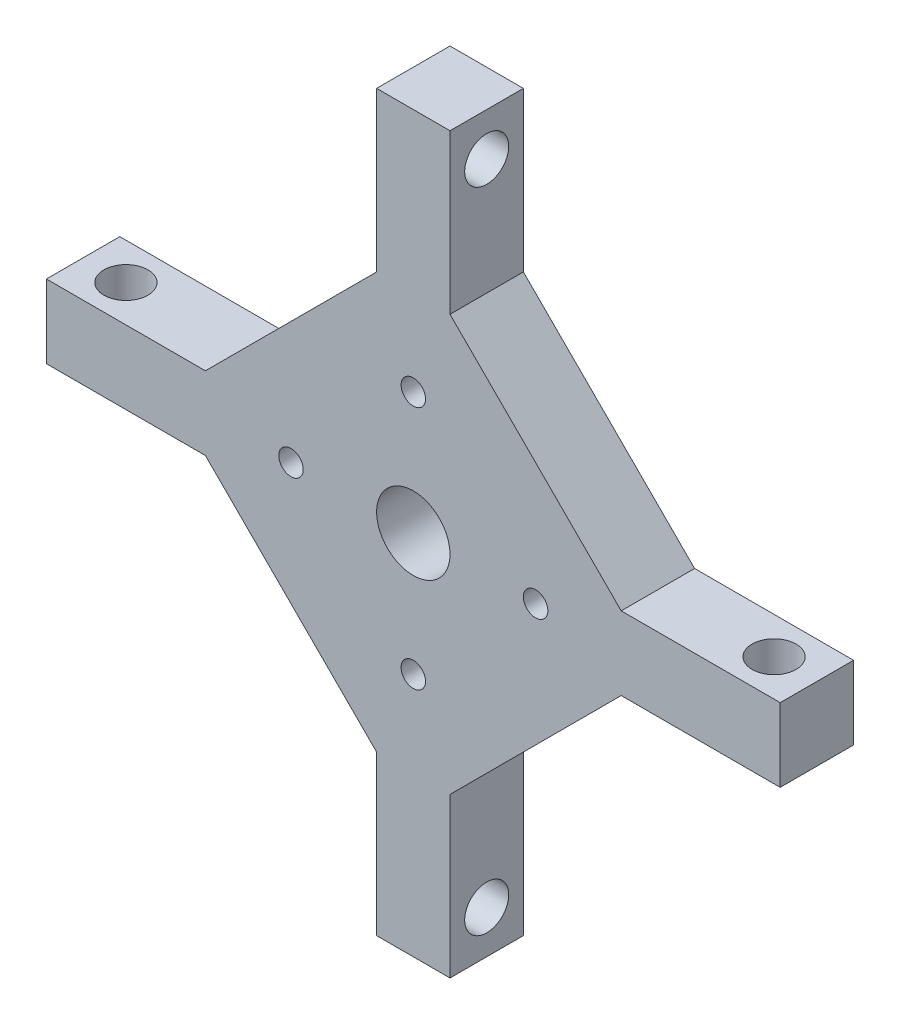
ISO-10303-21;
HEADER;
FILE_DESCRIPTION(('STEP AP214'),'2;1');
FILE_NAME('part.step','',(''),(''),'','','');
FILE_SCHEMA(('AUTOMOTIVE_DESIGN { 1 0 10303 214 1 1 1 1 }'));
ENDSEC;
DATA;
#1=APPLICATION_CONTEXT('core data for automotive mechanical design processes');
#2=APPLICATION_PROTOCOL_DEFINITION('international standard','automotive_design',2000,#1);
#3=PRODUCT_CONTEXT('',#1,'mechanical');
#4=PRODUCT('Part','Part','',(#3));
#5=PRODUCT_RELATED_PRODUCT_CATEGORY('part','',(#4));
#6=PRODUCT_DEFINITION_FORMATION('','',#4);
#7=PRODUCT_DEFINITION_CONTEXT('part definition',#1,'design');
#8=PRODUCT_DEFINITION('design','',#6,#7);
#9=PRODUCT_DEFINITION_SHAPE('','',#8);
#10=(LENGTH_UNIT() NAMED_UNIT(*) SI_UNIT(.MILLI.,.METRE.));
#11=(NAMED_UNIT(*) PLANE_ANGLE_UNIT() SI_UNIT($,.RADIAN.));
#12=(NAMED_UNIT(*) SI_UNIT($,.STERADIAN.) SOLID_ANGLE_UNIT());
#13=UNCERTAINTY_MEASURE_WITH_UNIT(LENGTH_MEASURE(1.E-05),#10,'distance_accuracy_value','');
#14=(GEOMETRIC_REPRESENTATION_CONTEXT(3) GLOBAL_UNCERTAINTY_ASSIGNED_CONTEXT((#13)) GLOBAL_UNIT_ASSIGNED_CONTEXT((#10,
#11,#12)) REPRESENTATION_CONTEXT('',''));
#15=CARTESIAN_POINT('',(0.,0.,0.));
#16=DIRECTION('',(0.,0.,1.));
#17=DIRECTION('',(1.,0.,0.));
#18=AXIS2_PLACEMENT_3D('',#15,#16,#17);
#19=CARTESIAN_POINT('',(0.,3.,6.));
#20=DIRECTION('',(0.,1.,0.));
#21=DIRECTION('',(-1.,0.,0.));
#22=AXIS2_PLACEMENT_3D('',#19,#20,#21);
#23=PLANE('',#22);
#24=CARTESIAN_POINT('',(-26.5,2.99999999999992,3.));
#25=DIRECTION('',(0.,1.,0.));
#26=DIRECTION('',(-1.,0.,0.));
#27=AXIS2_PLACEMENT_3D('',#24,#25,#26);
#28=CIRCLE('',#27,1.8);
#29=CARTESIAN_POINT('',(-28.3,2.99999999999991,3.));
#30=VERTEX_POINT('',#29);
#31=EDGE_CURVE('E285',#30,#30,#28,.T.);
#32=ORIENTED_EDGE('',*,*,#31,.F.);
#33=EDGE_LOOP('',(#32));
#34=FACE_BOUND('',#33,.T.);
#35=DIRECTION('',(1.,0.,0.));
#36=VECTOR('',#35,1.);
#37=CARTESIAN_POINT('',(0.,3.,0.));
#38=LINE('',#37,#36);
#39=CARTESIAN_POINT('',(-30.,2.99999999999999,0.));
#40=VERTEX_POINT('',#39);
#41=CARTESIAN_POINT('',(-17.,2.99999999999999,0.));
#42=VERTEX_POINT('',#41);
#43=EDGE_CURVE('E183',#40,#42,#38,.T.);
#44=ORIENTED_EDGE('',*,*,#43,.F.);
#45=DIRECTION('',(0.,0.,-1.));
#46=VECTOR('',#45,1.);
#47=CARTESIAN_POINT('',(-30.,2.99999999999999,6.));
#48=LINE('',#47,#46);
#49=CARTESIAN_POINT('',(-30.,2.99999999999999,6.));
#50=VERTEX_POINT('',#49);
#51=EDGE_CURVE('E11',#50,#40,#48,.T.);
#52=ORIENTED_EDGE('',*,*,#51,.F.);
#53=DIRECTION('',(1.,0.,0.));
#54=VECTOR('',#53,1.);
#55=CARTESIAN_POINT('',(0.,3.,6.));
#56=LINE('',#55,#54);
#57=CARTESIAN_POINT('',(-17.,2.99999999999999,6.));
#58=VERTEX_POINT('',#57);
#59=EDGE_CURVE('E224',#50,#58,#56,.T.);
#60=ORIENTED_EDGE('',*,*,#59,.T.);
#61=DIRECTION('',(0.,0.,-1.));
#62=VECTOR('',#61,1.);
#63=CARTESIAN_POINT('',(-17.,2.99999999999999,6.));
#64=LINE('',#63,#62);
#65=EDGE_CURVE('E116',#58,#42,#64,.T.);
#66=ORIENTED_EDGE('',*,*,#65,.T.);
#67=EDGE_LOOP('',(#44,#52,#60,#66));
#68=FACE_BOUND('',#67,.T.);
#69=ADVANCED_FACE('F40',(#34,#68),#23,.T.);
#70=CARTESIAN_POINT('',(-30.,0.,6.));
#71=DIRECTION('',(-1.,0.,0.));
#72=DIRECTION('',(0.,-1.,0.));
#73=AXIS2_PLACEMENT_3D('',#70,#71,#72);
#74=PLANE('',#73);
#75=DIRECTION('',(0.,1.,0.));
#76=VECTOR('',#75,1.);
#77=CARTESIAN_POINT('',(-30.,0.,0.));
#78=LINE('',#77,#76);
#79=CARTESIAN_POINT('',(-30.,-3.00000000000001,0.));
#80=VERTEX_POINT('',#79);
#81=EDGE_CURVE('E186',#80,#40,#78,.T.);
#82=ORIENTED_EDGE('',*,*,#81,.F.);
#83=DIRECTION('',(0.,0.,-1.));
#84=VECTOR('',#83,1.);
#85=CARTESIAN_POINT('',(-30.,-3.00000000000001,6.));
#86=LINE('',#85,#84);
#87=CARTESIAN_POINT('',(-30.,-3.00000000000001,6.));
#88=VERTEX_POINT('',#87);
#89=EDGE_CURVE('E49',#88,#80,#86,.T.);
#90=ORIENTED_EDGE('',*,*,#89,.F.);
#91=DIRECTION('',(0.,1.,0.));
#92=VECTOR('',#91,1.);
#93=CARTESIAN_POINT('',(-30.,0.,6.));
#94=LINE('',#93,#92);
#95=EDGE_CURVE('E304',#88,#50,#94,.T.);
#96=ORIENTED_EDGE('',*,*,#95,.T.);
#97=ORIENTED_EDGE('',*,*,#51,.T.);
#98=EDGE_LOOP('',(#82,#90,#96,#97));
#99=FACE_BOUND('',#98,.T.);
#100=ADVANCED_FACE('F347',(#99),#74,.T.);
#101=CARTESIAN_POINT('',(0.,-3.,6.));
#102=DIRECTION('',(0.,1.,0.));
#103=DIRECTION('',(-1.,0.,0.));
#104=AXIS2_PLACEMENT_3D('',#101,#102,#103);
#105=PLANE('',#104);
#106=CARTESIAN_POINT('',(-26.5,-3.00000000000008,3.));
#107=DIRECTION('',(0.,1.,0.));
#108=DIRECTION('',(-1.,0.,0.));
#109=AXIS2_PLACEMENT_3D('',#106,#107,#108);
#110=CIRCLE('',#109,1.8);
#111=CARTESIAN_POINT('',(-28.3,-3.00000000000009,3.));
#112=VERTEX_POINT('',#111);
#113=EDGE_CURVE('E281',#112,#112,#110,.T.);
#114=ORIENTED_EDGE('',*,*,#113,.T.);
#115=EDGE_LOOP('',(#114));
#116=FACE_BOUND('',#115,.T.);
#117=DIRECTION('',(1.,0.,0.));
#118=VECTOR('',#117,1.);
#119=CARTESIAN_POINT('',(0.,-3.,0.));
#120=LINE('',#119,#118);
#121=CARTESIAN_POINT('',(-17.,-3.00000000000001,0.));
#122=VERTEX_POINT('',#121);
#123=EDGE_CURVE('E190',#80,#122,#120,.T.);
#124=ORIENTED_EDGE('',*,*,#123,.T.);
#125=DIRECTION('',(0.,0.,-1.));
#126=VECTOR('',#125,1.);
#127=CARTESIAN_POINT('',(-17.,-3.00000000000001,6.));
#128=LINE('',#127,#126);
#129=CARTESIAN_POINT('',(-17.,-3.00000000000001,6.));
#130=VERTEX_POINT('',#129);
#131=EDGE_CURVE('E248',#130,#122,#128,.T.);
#132=ORIENTED_EDGE('',*,*,#131,.F.);
#133=DIRECTION('',(1.,0.,0.));
#134=VECTOR('',#133,1.);
#135=CARTESIAN_POINT('',(0.,-3.,6.));
#136=LINE('',#135,#134);
#137=EDGE_CURVE('E307',#88,#130,#136,.T.);
#138=ORIENTED_EDGE('',*,*,#137,.F.);
#139=ORIENTED_EDGE('',*,*,#89,.T.);
#140=EDGE_LOOP('',(#124,#132,#138,#139));
#141=FACE_BOUND('',#140,.T.);
#142=ADVANCED_FACE('F352',(#116,#141),#105,.F.);
#143=CARTESIAN_POINT('',(-9.99999999999998,-9.99999999999999,6.));
#144=DIRECTION('',(0.707106781186547,0.707106781186548,0.));
#145=DIRECTION('',(-0.707106781186548,0.707106781186547,0.));
#146=AXIS2_PLACEMENT_3D('',#143,#144,#145);
#147=PLANE('',#146);
#148=DIRECTION('',(0.707106781186548,-0.707106781186547,0.));
#149=VECTOR('',#148,1.);
#150=CARTESIAN_POINT('',(-9.99999999999998,-9.99999999999999,0.));
#151=LINE('',#150,#149);
#152=CARTESIAN_POINT('',(-2.99999999999998,-17.,0.));
#153=VERTEX_POINT('',#152);
#154=EDGE_CURVE('E192',#122,#153,#151,.T.);
#155=ORIENTED_EDGE('',*,*,#154,.T.);
#156=DIRECTION('',(0.,0.,-1.));
#157=VECTOR('',#156,1.);
#158=CARTESIAN_POINT('',(-2.99999999999998,-17.,6.));
#159=LINE('',#158,#157);
#160=CARTESIAN_POINT('',(-2.99999999999998,-17.,6.));
#161=VERTEX_POINT('',#160);
#162=EDGE_CURVE('E246',#161,#153,#159,.T.);
#163=ORIENTED_EDGE('',*,*,#162,.F.);
#164=DIRECTION('',(0.707106781186548,-0.707106781186547,0.));
#165=VECTOR('',#164,1.);
#166=CARTESIAN_POINT('',(-9.99999999999998,-9.99999999999999,6.));
#167=LINE('',#166,#165);
#168=EDGE_CURVE('E309',#130,#161,#167,.T.);
#169=ORIENTED_EDGE('',*,*,#168,.F.);
#170=ORIENTED_EDGE('',*,*,#131,.T.);
#171=EDGE_LOOP('',(#155,#163,#169,#170));
#172=FACE_BOUND('',#171,.T.);
#173=ADVANCED_FACE('F358',(#172),#147,.F.);
#174=CARTESIAN_POINT('',(-2.99999999999998,0.,6.));
#175=DIRECTION('',(-1.,0.,0.));
#176=DIRECTION('',(0.,-1.,0.));
#177=AXIS2_PLACEMENT_3D('',#174,#175,#176);
#178=PLANE('',#177);
#179=CARTESIAN_POINT('',(-3.00000000000001,-26.5,3.));
#180=DIRECTION('',(-1.,0.,0.));
#181=DIRECTION('',(0.,-1.,0.));
#182=AXIS2_PLACEMENT_3D('',#179,#180,#181);
#183=CIRCLE('',#182,1.8);
#184=CARTESIAN_POINT('',(-3.00000000000001,-28.3,3.));
#185=VERTEX_POINT('',#184);
#186=EDGE_CURVE('E291',#185,#185,#183,.T.);
#187=ORIENTED_EDGE('',*,*,#186,.F.);
#188=EDGE_LOOP('',(#187));
#189=FACE_BOUND('',#188,.T.);
#190=DIRECTION('',(0.,1.,0.));
#191=VECTOR('',#190,1.);
#192=CARTESIAN_POINT('',(-2.99999999999998,0.,0.));
#193=LINE('',#192,#191);
#194=CARTESIAN_POINT('',(-2.99999999999997,-30.,0.));
#195=VERTEX_POINT('',#194);
#196=EDGE_CURVE('E195',#195,#153,#193,.T.);
#197=ORIENTED_EDGE('',*,*,#196,.F.);
#198=DIRECTION('',(0.,0.,-1.));
#199=VECTOR('',#198,1.);
#200=CARTESIAN_POINT('',(-2.99999999999997,-30.,6.));
#201=LINE('',#200,#199);
#202=CARTESIAN_POINT('',(-2.99999999999997,-30.,6.));
#203=VERTEX_POINT('',#202);
#204=EDGE_CURVE('E244',#203,#195,#201,.T.);
#205=ORIENTED_EDGE('',*,*,#204,.F.);
#206=DIRECTION('',(0.,1.,0.));
#207=VECTOR('',#206,1.);
#208=CARTESIAN_POINT('',(-2.99999999999998,0.,6.));
#209=LINE('',#208,#207);
#210=EDGE_CURVE('E311',#203,#161,#209,.T.);
#211=ORIENTED_EDGE('',*,*,#210,.T.);
#212=ORIENTED_EDGE('',*,*,#162,.T.);
#213=EDGE_LOOP('',(#197,#205,#211,#212));
#214=FACE_BOUND('',#213,.T.);
#215=ADVANCED_FACE('F362',(#189,#214),#178,.T.);
#216=CARTESIAN_POINT('',(0.,-30.,6.));
#217=DIRECTION('',(0.,-1.,0.));
#218=DIRECTION('',(1.,0.,0.));
#219=AXIS2_PLACEMENT_3D('',#216,#217,#218);
#220=PLANE('',#219);
#221=DIRECTION('',(-1.,0.,0.));
#222=VECTOR('',#221,1.);
#223=CARTESIAN_POINT('',(0.,-30.,0.));
#224=LINE('',#223,#222);
#225=CARTESIAN_POINT('',(3.00000000000003,-30.,0.));
#226=VERTEX_POINT('',#225);
#227=EDGE_CURVE('E198',#226,#195,#224,.T.);
#228=ORIENTED_EDGE('',*,*,#227,.F.);
#229=DIRECTION('',(0.,0.,-1.));
#230=VECTOR('',#229,1.);
#231=CARTESIAN_POINT('',(3.00000000000003,-30.,6.));
#232=LINE('',#231,#230);
#233=CARTESIAN_POINT('',(3.00000000000003,-30.,6.));
#234=VERTEX_POINT('',#233);
#235=EDGE_CURVE('E242',#234,#226,#232,.T.);
#236=ORIENTED_EDGE('',*,*,#235,.F.);
#237=DIRECTION('',(-1.,0.,0.));
#238=VECTOR('',#237,1.);
#239=CARTESIAN_POINT('',(0.,-30.,6.));
#240=LINE('',#239,#238);
#241=EDGE_CURVE('E314',#234,#203,#240,.T.);
#242=ORIENTED_EDGE('',*,*,#241,.T.);
#243=ORIENTED_EDGE('',*,*,#204,.T.);
#244=EDGE_LOOP('',(#228,#236,#242,#243));
#245=FACE_BOUND('',#244,.T.);
#246=ADVANCED_FACE('F365',(#245),#220,.T.);
#247=CARTESIAN_POINT('',(3.00000000000003,0.,6.));
#248=DIRECTION('',(-1.,0.,0.));
#249=DIRECTION('',(0.,0.,1.));
#250=AXIS2_PLACEMENT_3D('',#247,#248,#249);
#251=PLANE('',#250);
#252=CARTESIAN_POINT('',(2.99999999999999,-26.5,3.));
#253=DIRECTION('',(-1.,0.,0.));
#254=DIRECTION('',(0.,-1.,0.));
#255=AXIS2_PLACEMENT_3D('',#252,#253,#254);
#256=CIRCLE('',#255,1.8);
#257=CARTESIAN_POINT('',(2.99999999999999,-28.3,3.));
#258=VERTEX_POINT('',#257);
#259=EDGE_CURVE('E288',#258,#258,#256,.T.);
#260=ORIENTED_EDGE('',*,*,#259,.T.);
#261=EDGE_LOOP('',(#260));
#262=FACE_BOUND('',#261,.T.);
#263=DIRECTION('',(0.,1.,0.));
#264=VECTOR('',#263,1.);
#265=CARTESIAN_POINT('',(3.00000000000003,0.,0.));
#266=LINE('',#265,#264);
#267=CARTESIAN_POINT('',(3.00000000000003,-17.,0.));
#268=VERTEX_POINT('',#267);
#269=EDGE_CURVE('E201',#226,#268,#266,.T.);
#270=ORIENTED_EDGE('',*,*,#269,.T.);
#271=DIRECTION('',(0.,0.,-1.));
#272=VECTOR('',#271,1.);
#273=CARTESIAN_POINT('',(3.00000000000003,-17.,6.));
#274=LINE('',#273,#272);
#275=CARTESIAN_POINT('',(3.00000000000003,-17.,6.));
#276=VERTEX_POINT('',#275);
#277=EDGE_CURVE('E239',#276,#268,#274,.T.);
#278=ORIENTED_EDGE('',*,*,#277,.F.);
#279=DIRECTION('',(0.,1.,0.));
#280=VECTOR('',#279,1.);
#281=CARTESIAN_POINT('',(3.00000000000003,0.,6.));
#282=LINE('',#281,#280);
#283=EDGE_CURVE('E317',#234,#276,#282,.T.);
#284=ORIENTED_EDGE('',*,*,#283,.F.);
#285=ORIENTED_EDGE('',*,*,#235,.T.);
#286=EDGE_LOOP('',(#270,#278,#284,#285));
#287=FACE_BOUND('',#286,.T.);
#288=ADVANCED_FACE('F372',(#262,#287),#251,.F.);
#289=CARTESIAN_POINT('',(10.,-10.,6.));
#290=DIRECTION('',(-0.707106781186547,0.707106781186547,0.));
#291=DIRECTION('',(-0.707106781186548,-0.707106781186548,0.));
#292=AXIS2_PLACEMENT_3D('',#289,#290,#291);
#293=PLANE('',#292);
#294=DIRECTION('',(0.707106781186548,0.707106781186548,0.));
#295=VECTOR('',#294,1.);
#296=CARTESIAN_POINT('',(10.,-10.,0.));
#297=LINE('',#296,#295);
#298=CARTESIAN_POINT('',(17.,-3.,0.));
#299=VERTEX_POINT('',#298);
#300=EDGE_CURVE('E203',#268,#299,#297,.T.);
#301=ORIENTED_EDGE('',*,*,#300,.T.);
#302=DIRECTION('',(0.,0.,-1.));
#303=VECTOR('',#302,1.);
#304=CARTESIAN_POINT('',(17.,-3.,6.));
#305=LINE('',#304,#303);
#306=CARTESIAN_POINT('',(17.,-3.,6.));
#307=VERTEX_POINT('',#306);
#308=EDGE_CURVE('E237',#307,#299,#305,.T.);
#309=ORIENTED_EDGE('',*,*,#308,.F.);
#310=DIRECTION('',(0.707106781186548,0.707106781186548,0.));
#311=VECTOR('',#310,1.);
#312=CARTESIAN_POINT('',(10.,-10.,6.));
#313=LINE('',#312,#311);
#314=EDGE_CURVE('E319',#276,#307,#313,.T.);
#315=ORIENTED_EDGE('',*,*,#314,.F.);
#316=ORIENTED_EDGE('',*,*,#277,.T.);
#317=EDGE_LOOP('',(#301,#309,#315,#316));
#318=FACE_BOUND('',#317,.T.);
#319=ADVANCED_FACE('F376',(#318),#293,.F.);
#320=CARTESIAN_POINT('',(0.,-3.,6.));
#321=DIRECTION('',(0.,-1.,0.));
#322=DIRECTION('',(1.,0.,0.));
#323=AXIS2_PLACEMENT_3D('',#320,#321,#322);
#324=PLANE('',#323);
#325=CARTESIAN_POINT('',(26.5,-2.99999999999973,3.));
#326=DIRECTION('',(0.,-1.,0.));
#327=DIRECTION('',(1.,0.,0.));
#328=AXIS2_PLACEMENT_3D('',#325,#326,#327);
#329=CIRCLE('',#328,1.8);
#330=CARTESIAN_POINT('',(28.3,-2.99999999999972,3.));
#331=VERTEX_POINT('',#330);
#332=EDGE_CURVE('E278',#331,#331,#329,.T.);
#333=ORIENTED_EDGE('',*,*,#332,.F.);
#334=EDGE_LOOP('',(#333));
#335=FACE_BOUND('',#334,.T.);
#336=DIRECTION('',(-1.,0.,0.));
#337=VECTOR('',#336,1.);
#338=CARTESIAN_POINT('',(0.,-3.,0.));
#339=LINE('',#338,#337);
#340=CARTESIAN_POINT('',(30.,-3.,0.));
#341=VERTEX_POINT('',#340);
#342=EDGE_CURVE('E206',#341,#299,#339,.T.);
#343=ORIENTED_EDGE('',*,*,#342,.F.);
#344=DIRECTION('',(0.,0.,-1.));
#345=VECTOR('',#344,1.);
#346=CARTESIAN_POINT('',(30.,-3.,6.));
#347=LINE('',#346,#345);
#348=CARTESIAN_POINT('',(30.,-3.,6.));
#349=VERTEX_POINT('',#348);
#350=EDGE_CURVE('E235',#349,#341,#347,.T.);
#351=ORIENTED_EDGE('',*,*,#350,.F.);
#352=DIRECTION('',(-1.,0.,0.));
#353=VECTOR('',#352,1.);
#354=CARTESIAN_POINT('',(0.,-3.,6.));
#355=LINE('',#354,#353);
#356=EDGE_CURVE('E321',#349,#307,#355,.T.);
#357=ORIENTED_EDGE('',*,*,#356,.T.);
#358=ORIENTED_EDGE('',*,*,#308,.T.);
#359=EDGE_LOOP('',(#343,#351,#357,#358));
#360=FACE_BOUND('',#359,.T.);
#361=ADVANCED_FACE('F379',(#335,#360),#324,.T.);
#362=CARTESIAN_POINT('',(30.,0.,6.));
#363=DIRECTION('',(1.,0.,0.));
#364=DIRECTION('',(0.,1.,0.));
#365=AXIS2_PLACEMENT_3D('',#362,#363,#364);
#366=PLANE('',#365);
#367=DIRECTION('',(0.,-1.,0.));
#368=VECTOR('',#367,1.);
#369=CARTESIAN_POINT('',(30.,0.,0.));
#370=LINE('',#369,#368);
#371=CARTESIAN_POINT('',(30.,3.,0.));
#372=VERTEX_POINT('',#371);
#373=EDGE_CURVE('E209',#372,#341,#370,.T.);
#374=ORIENTED_EDGE('',*,*,#373,.F.);
#375=DIRECTION('',(0.,0.,-1.));
#376=VECTOR('',#375,1.);
#377=CARTESIAN_POINT('',(30.,3.,6.));
#378=LINE('',#377,#376);
#379=CARTESIAN_POINT('',(30.,3.,6.));
#380=VERTEX_POINT('',#379);
#381=EDGE_CURVE('E233',#380,#372,#378,.T.);
#382=ORIENTED_EDGE('',*,*,#381,.F.);
#383=DIRECTION('',(0.,-1.,0.));
#384=VECTOR('',#383,1.);
#385=CARTESIAN_POINT('',(30.,0.,6.));
#386=LINE('',#385,#384);
#387=EDGE_CURVE('E324',#380,#349,#386,.T.);
#388=ORIENTED_EDGE('',*,*,#387,.T.);
#389=ORIENTED_EDGE('',*,*,#350,.T.);
#390=EDGE_LOOP('',(#374,#382,#388,#389));
#391=FACE_BOUND('',#390,.T.);
#392=ADVANCED_FACE('F382',(#391),#366,.T.);
#393=CARTESIAN_POINT('',(0.,3.,6.));
#394=DIRECTION('',(0.,-1.,0.));
#395=DIRECTION('',(1.,0.,0.));
#396=AXIS2_PLACEMENT_3D('',#393,#394,#395);
#397=PLANE('',#396);
#398=CARTESIAN_POINT('',(26.4999999999999,3.00000000000027,3.));
#399=DIRECTION('',(0.,-1.,0.));
#400=DIRECTION('',(1.,0.,0.));
#401=AXIS2_PLACEMENT_3D('',#398,#399,#400);
#402=CIRCLE('',#401,1.8);
#403=CARTESIAN_POINT('',(28.2999999999999,3.00000000000028,3.));
#404=VERTEX_POINT('',#403);
#405=EDGE_CURVE('E294',#404,#404,#402,.T.);
#406=ORIENTED_EDGE('',*,*,#405,.T.);
#407=EDGE_LOOP('',(#406));
#408=FACE_BOUND('',#407,.T.);
#409=DIRECTION('',(-1.,0.,0.));
#410=VECTOR('',#409,1.);
#411=CARTESIAN_POINT('',(0.,3.,0.));
#412=LINE('',#411,#410);
#413=CARTESIAN_POINT('',(17.,3.,0.));
#414=VERTEX_POINT('',#413);
#415=EDGE_CURVE('E212',#372,#414,#412,.T.);
#416=ORIENTED_EDGE('',*,*,#415,.T.);
#417=DIRECTION('',(0.,0.,-1.));
#418=VECTOR('',#417,1.);
#419=CARTESIAN_POINT('',(17.,3.,6.));
#420=LINE('',#419,#418);
#421=CARTESIAN_POINT('',(17.,3.,6.));
#422=VERTEX_POINT('',#421);
#423=EDGE_CURVE('E230',#422,#414,#420,.T.);
#424=ORIENTED_EDGE('',*,*,#423,.F.);
#425=DIRECTION('',(-1.,0.,0.));
#426=VECTOR('',#425,1.);
#427=CARTESIAN_POINT('',(0.,3.,6.));
#428=LINE('',#427,#426);
#429=EDGE_CURVE('E327',#380,#422,#428,.T.);
#430=ORIENTED_EDGE('',*,*,#429,.F.);
#431=ORIENTED_EDGE('',*,*,#381,.T.);
#432=EDGE_LOOP('',(#416,#424,#430,#431));
#433=FACE_BOUND('',#432,.T.);
#434=ADVANCED_FACE('F385',(#408,#433),#397,.F.);
#435=CARTESIAN_POINT('',(10.,10.,6.));
#436=DIRECTION('',(-0.707106781186547,-0.707106781186548,0.));
#437=DIRECTION('',(0.707106781186548,-0.707106781186547,0.));
#438=AXIS2_PLACEMENT_3D('',#435,#436,#437);
#439=PLANE('',#438);
#440=DIRECTION('',(-0.707106781186548,0.707106781186547,0.));
#441=VECTOR('',#440,1.);
#442=CARTESIAN_POINT('',(10.,10.,0.));
#443=LINE('',#442,#441);
#444=CARTESIAN_POINT('',(3.00000000000002,17.,0.));
#445=VERTEX_POINT('',#444);
#446=EDGE_CURVE('E214',#414,#445,#443,.T.);
#447=ORIENTED_EDGE('',*,*,#446,.T.);
#448=DIRECTION('',(0.,0.,-1.));
#449=VECTOR('',#448,1.);
#450=CARTESIAN_POINT('',(3.00000000000002,17.,6.));
#451=LINE('',#450,#449);
#452=CARTESIAN_POINT('',(3.00000000000002,17.,6.));
#453=VERTEX_POINT('',#452);
#454=EDGE_CURVE('E228',#453,#445,#451,.T.);
#455=ORIENTED_EDGE('',*,*,#454,.F.);
#456=DIRECTION('',(-0.707106781186548,0.707106781186547,0.));
#457=VECTOR('',#456,1.);
#458=CARTESIAN_POINT('',(10.,10.,6.));
#459=LINE('',#458,#457);
#460=EDGE_CURVE('E178',#422,#453,#459,.T.);
#461=ORIENTED_EDGE('',*,*,#460,.F.);
#462=ORIENTED_EDGE('',*,*,#423,.T.);
#463=EDGE_LOOP('',(#447,#455,#461,#462));
#464=FACE_BOUND('',#463,.T.);
#465=ADVANCED_FACE('F334',(#464),#439,.F.);
#466=CARTESIAN_POINT('',(3.00000000000002,0.,6.));
#467=DIRECTION('',(1.,0.,0.));
#468=DIRECTION('',(0.,1.,0.));
#469=AXIS2_PLACEMENT_3D('',#466,#467,#468);
#470=PLANE('',#469);
#471=CARTESIAN_POINT('',(3.00000000000001,26.5,3.));
#472=DIRECTION('',(1.,0.,0.));
#473=DIRECTION('',(0.,1.,0.));
#474=AXIS2_PLACEMENT_3D('',#471,#472,#473);
#475=CIRCLE('',#474,1.8);
#476=CARTESIAN_POINT('',(3.00000000000001,28.3,3.));
#477=VERTEX_POINT('',#476);
#478=EDGE_CURVE('E284',#477,#477,#475,.T.);
#479=ORIENTED_EDGE('',*,*,#478,.F.);
#480=EDGE_LOOP('',(#479));
#481=FACE_BOUND('',#480,.T.);
#482=DIRECTION('',(0.,-1.,0.));
#483=VECTOR('',#482,1.);
#484=CARTESIAN_POINT('',(3.00000000000002,0.,0.));
#485=LINE('',#484,#483);
#486=CARTESIAN_POINT('',(3.00000000000001,30.,0.));
#487=VERTEX_POINT('',#486);
#488=EDGE_CURVE('E217',#487,#445,#485,.T.);
#489=ORIENTED_EDGE('',*,*,#488,.F.);
#490=DIRECTION('',(0.,0.,-1.));
#491=VECTOR('',#490,1.);
#492=CARTESIAN_POINT('',(3.00000000000001,30.,6.));
#493=LINE('',#492,#491);
#494=CARTESIAN_POINT('',(3.00000000000001,30.,6.));
#495=VERTEX_POINT('',#494);
#496=EDGE_CURVE('E167',#495,#487,#493,.T.);
#497=ORIENTED_EDGE('',*,*,#496,.F.);
#498=DIRECTION('',(0.,-1.,0.));
#499=VECTOR('',#498,1.);
#500=CARTESIAN_POINT('',(3.00000000000002,0.,6.));
#501=LINE('',#500,#499);
#502=EDGE_CURVE('E176',#495,#453,#501,.T.);
#503=ORIENTED_EDGE('',*,*,#502,.T.);
#504=ORIENTED_EDGE('',*,*,#454,.T.);
#505=EDGE_LOOP('',(#489,#497,#503,#504));
#506=FACE_BOUND('',#505,.T.);
#507=ADVANCED_FACE('F338',(#481,#506),#470,.T.);
#508=CARTESIAN_POINT('',(0.,30.,6.));
#509=DIRECTION('',(0.,1.,0.));
#510=DIRECTION('',(-1.,0.,0.));
#511=AXIS2_PLACEMENT_3D('',#508,#509,#510);
#512=PLANE('',#511);
#513=DIRECTION('',(1.,0.,0.));
#514=VECTOR('',#513,1.);
#515=CARTESIAN_POINT('',(0.,30.,0.));
#516=LINE('',#515,#514);
#517=CARTESIAN_POINT('',(-2.99999999999999,30.,0.));
#518=VERTEX_POINT('',#517);
#519=EDGE_CURVE('E166',#518,#487,#516,.T.);
#520=ORIENTED_EDGE('',*,*,#519,.F.);
#521=DIRECTION('',(0.,0.,-1.));
#522=VECTOR('',#521,1.);
#523=CARTESIAN_POINT('',(-2.99999999999999,30.,6.));
#524=LINE('',#523,#522);
#525=CARTESIAN_POINT('',(-2.99999999999999,30.,6.));
#526=VERTEX_POINT('',#525);
#527=EDGE_CURVE('E160',#526,#518,#524,.T.);
#528=ORIENTED_EDGE('',*,*,#527,.F.);
#529=DIRECTION('',(1.,0.,0.));
#530=VECTOR('',#529,1.);
#531=CARTESIAN_POINT('',(0.,30.,6.));
#532=LINE('',#531,#530);
#533=EDGE_CURVE('E164',#526,#495,#532,.T.);
#534=ORIENTED_EDGE('',*,*,#533,.T.);
#535=ORIENTED_EDGE('',*,*,#496,.T.);
#536=EDGE_LOOP('',(#520,#528,#534,#535));
#537=FACE_BOUND('',#536,.T.);
#538=ADVANCED_FACE('F162',(#537),#512,.T.);
#539=CARTESIAN_POINT('',(-2.99999999999998,0.,6.));
#540=DIRECTION('',(1.,0.,0.));
#541=DIRECTION('',(0.,1.,0.));
#542=AXIS2_PLACEMENT_3D('',#539,#540,#541);
#543=PLANE('',#542);
#544=CARTESIAN_POINT('',(-2.99999999999999,26.5,3.));
#545=DIRECTION('',(1.,0.,0.));
#546=DIRECTION('',(0.,1.,0.));
#547=AXIS2_PLACEMENT_3D('',#544,#545,#546);
#548=CIRCLE('',#547,1.8);
#549=CARTESIAN_POINT('',(-2.99999999999999,28.3,3.));
#550=VERTEX_POINT('',#549);
#551=EDGE_CURVE('E187',#550,#550,#548,.T.);
#552=ORIENTED_EDGE('',*,*,#551,.T.);
#553=EDGE_LOOP('',(#552));
#554=FACE_BOUND('',#553,.T.);
#555=DIRECTION('',(0.,-1.,0.));
#556=VECTOR('',#555,1.);
#557=CARTESIAN_POINT('',(-2.99999999999998,0.,0.));
#558=LINE('',#557,#556);
#559=CARTESIAN_POINT('',(-2.99999999999998,17.,0.));
#560=VERTEX_POINT('',#559);
#561=EDGE_CURVE('E109',#518,#560,#558,.T.);
#562=ORIENTED_EDGE('',*,*,#561,.T.);
#563=DIRECTION('',(0.,0.,-1.));
#564=VECTOR('',#563,1.);
#565=CARTESIAN_POINT('',(-2.99999999999998,17.,6.));
#566=LINE('',#565,#564);
#567=CARTESIAN_POINT('',(-2.99999999999998,17.,6.));
#568=VERTEX_POINT('',#567);
#569=EDGE_CURVE('E168',#568,#560,#566,.T.);
#570=ORIENTED_EDGE('',*,*,#569,.F.);
#571=DIRECTION('',(0.,-1.,0.));
#572=VECTOR('',#571,1.);
#573=CARTESIAN_POINT('',(-2.99999999999998,0.,6.));
#574=LINE('',#573,#572);
#575=EDGE_CURVE('E170',#526,#568,#574,.T.);
#576=ORIENTED_EDGE('',*,*,#575,.F.);
#577=ORIENTED_EDGE('',*,*,#527,.T.);
#578=EDGE_LOOP('',(#562,#570,#576,#577));
#579=FACE_BOUND('',#578,.T.);
#580=ADVANCED_FACE('F171',(#554,#579),#543,.F.);
#581=CARTESIAN_POINT('',(-9.99999999999999,9.99999999999998,6.));
#582=DIRECTION('',(0.707106781186548,-0.707106781186547,0.));
#583=DIRECTION('',(0.707106781186547,0.707106781186548,0.));
#584=AXIS2_PLACEMENT_3D('',#581,#582,#583);
#585=PLANE('',#584);
#586=DIRECTION('',(-0.707106781186547,-0.707106781186548,0.));
#587=VECTOR('',#586,1.);
#588=CARTESIAN_POINT('',(-9.99999999999999,9.99999999999998,0.));
#589=LINE('',#588,#587);
#590=EDGE_CURVE('E222',#560,#42,#589,.T.);
#591=ORIENTED_EDGE('',*,*,#590,.T.);
#592=ORIENTED_EDGE('',*,*,#65,.F.);
#593=DIRECTION('',(-0.707106781186547,-0.707106781186548,0.));
#594=VECTOR('',#593,1.);
#595=CARTESIAN_POINT('',(-9.99999999999999,9.99999999999998,6.));
#596=LINE('',#595,#594);
#597=EDGE_CURVE('E58',#568,#58,#596,.T.);
#598=ORIENTED_EDGE('',*,*,#597,.F.);
#599=ORIENTED_EDGE('',*,*,#569,.T.);
#600=EDGE_LOOP('',(#591,#592,#598,#599));
#601=FACE_BOUND('',#600,.T.);
#602=ADVANCED_FACE('F343',(#601),#585,.F.);
#603=CARTESIAN_POINT('',(0.,0.,6.));
#604=DIRECTION('',(0.,0.,1.));
#605=DIRECTION('',(1.,0.,0.));
#606=AXIS2_PLACEMENT_3D('',#603,#604,#605);
#607=PLANE('',#606);
#608=CARTESIAN_POINT('',(-10.,0.,6.));
#609=DIRECTION('',(0.,0.,1.));
#610=DIRECTION('',(0.,1.,0.));
#611=AXIS2_PLACEMENT_3D('',#608,#609,#610);
#612=CIRCLE('',#611,1.);
#613=CARTESIAN_POINT('',(-10.,0.999999999999965,6.));
#614=VERTEX_POINT('',#613);
#615=EDGE_CURVE('E260',#614,#614,#612,.T.);
#616=ORIENTED_EDGE('',*,*,#615,.F.);
#617=EDGE_LOOP('',(#616));
#618=FACE_BOUND('',#617,.T.);
#619=CARTESIAN_POINT('',(0.,-10.,6.));
#620=DIRECTION('',(0.,0.,1.));
#621=DIRECTION('',(-1.,0.,0.));
#622=AXIS2_PLACEMENT_3D('',#619,#620,#621);
#623=CIRCLE('',#622,1.);
#624=CARTESIAN_POINT('',(-1.,-10.,6.));
#625=VERTEX_POINT('',#624);
#626=EDGE_CURVE('E541',#625,#625,#623,.T.);
#627=ORIENTED_EDGE('',*,*,#626,.F.);
#628=EDGE_LOOP('',(#627));
#629=FACE_BOUND('',#628,.T.);
#630=CARTESIAN_POINT('',(10.,1.04744440165294E-13,6.));
#631=DIRECTION('',(0.,0.,1.));
#632=DIRECTION('',(0.,-1.,0.));
#633=AXIS2_PLACEMENT_3D('',#630,#631,#632);
#634=CIRCLE('',#633,1.);
#635=CARTESIAN_POINT('',(10.,-0.999999999999896,6.));
#636=VERTEX_POINT('',#635);
#637=EDGE_CURVE('E273',#636,#636,#634,.T.);
#638=ORIENTED_EDGE('',*,*,#637,.F.);
#639=EDGE_LOOP('',(#638));
#640=FACE_BOUND('',#639,.T.);
#641=CARTESIAN_POINT('',(0.,10.,6.));
#642=DIRECTION('',(0.,0.,1.));
#643=DIRECTION('',(1.,0.,0.));
#644=AXIS2_PLACEMENT_3D('',#641,#642,#643);
#645=CIRCLE('',#644,1.);
#646=CARTESIAN_POINT('',(1.,10.,6.));
#647=VERTEX_POINT('',#646);
#648=EDGE_CURVE('E256',#647,#647,#645,.T.);
#649=ORIENTED_EDGE('',*,*,#648,.F.);
#650=EDGE_LOOP('',(#649));
#651=FACE_BOUND('',#650,.T.);
#652=CARTESIAN_POINT('',(0.,0.,6.));
#653=DIRECTION('',(0.,0.,1.));
#654=DIRECTION('',(1.,0.,0.));
#655=AXIS2_PLACEMENT_3D('',#652,#653,#654);
#656=CIRCLE('',#655,3.);
#657=CARTESIAN_POINT('',(3.,0.,6.));
#658=VERTEX_POINT('',#657);
#659=EDGE_CURVE('E255',#658,#658,#656,.T.);
#660=ORIENTED_EDGE('',*,*,#659,.F.);
#661=EDGE_LOOP('',(#660));
#662=FACE_BOUND('',#661,.T.);
#663=ORIENTED_EDGE('',*,*,#59,.F.);
#664=ORIENTED_EDGE('',*,*,#95,.F.);
#665=ORIENTED_EDGE('',*,*,#137,.T.);
#666=ORIENTED_EDGE('',*,*,#168,.T.);
#667=ORIENTED_EDGE('',*,*,#210,.F.);
#668=ORIENTED_EDGE('',*,*,#241,.F.);
#669=ORIENTED_EDGE('',*,*,#283,.T.);
#670=ORIENTED_EDGE('',*,*,#314,.T.);
#671=ORIENTED_EDGE('',*,*,#356,.F.);
#672=ORIENTED_EDGE('',*,*,#387,.F.);
#673=ORIENTED_EDGE('',*,*,#429,.T.);
#674=ORIENTED_EDGE('',*,*,#460,.T.);
#675=ORIENTED_EDGE('',*,*,#502,.F.);
#676=ORIENTED_EDGE('',*,*,#533,.F.);
#677=ORIENTED_EDGE('',*,*,#575,.T.);
#678=ORIENTED_EDGE('',*,*,#597,.T.);
#679=EDGE_LOOP('',(#663,#664,#665,#666,#667,#668,#669,#670,#671,#672,#673,#674,#675,#676,#677,#678));
#680=FACE_BOUND('',#679,.T.);
#681=ADVANCED_FACE('F174',(#618,#629,#640,#651,#662,#680),#607,.T.);
#682=CARTESIAN_POINT('',(0.,0.,0.));
#683=DIRECTION('',(0.,0.,1.));
#684=DIRECTION('',(1.,0.,0.));
#685=AXIS2_PLACEMENT_3D('',#682,#683,#684);
#686=PLANE('',#685);
#687=CARTESIAN_POINT('',(-10.,0.,0.));
#688=DIRECTION('',(0.,0.,1.));
#689=DIRECTION('',(1.,0.,0.));
#690=AXIS2_PLACEMENT_3D('',#687,#688,#689);
#691=CIRCLE('',#690,1.);
#692=CARTESIAN_POINT('',(-9.,0.,0.));
#693=VERTEX_POINT('',#692);
#694=EDGE_CURVE('E43',#693,#693,#691,.T.);
#695=ORIENTED_EDGE('',*,*,#694,.T.);
#696=EDGE_LOOP('',(#695));
#697=FACE_BOUND('',#696,.T.);
#698=CARTESIAN_POINT('',(0.,-10.,0.));
#699=DIRECTION('',(0.,0.,1.));
#700=DIRECTION('',(1.,0.,0.));
#701=AXIS2_PLACEMENT_3D('',#698,#699,#700);
#702=CIRCLE('',#701,1.);
#703=CARTESIAN_POINT('',(1.,-10.,0.));
#704=VERTEX_POINT('',#703);
#705=EDGE_CURVE('E259',#704,#704,#702,.T.);
#706=ORIENTED_EDGE('',*,*,#705,.T.);
#707=EDGE_LOOP('',(#706));
#708=FACE_BOUND('',#707,.T.);
#709=CARTESIAN_POINT('',(10.,1.04744440165294E-13,0.));
#710=DIRECTION('',(0.,0.,1.));
#711=DIRECTION('',(1.,0.,0.));
#712=AXIS2_PLACEMENT_3D('',#709,#710,#711);
#713=CIRCLE('',#712,1.);
#714=CARTESIAN_POINT('',(11.,1.04744440165294E-13,0.));
#715=VERTEX_POINT('',#714);
#716=EDGE_CURVE('E257',#715,#715,#713,.T.);
#717=ORIENTED_EDGE('',*,*,#716,.T.);
#718=EDGE_LOOP('',(#717));
#719=FACE_BOUND('',#718,.T.);
#720=CARTESIAN_POINT('',(0.,10.,0.));
#721=DIRECTION('',(0.,0.,1.));
#722=DIRECTION('',(1.,0.,0.));
#723=AXIS2_PLACEMENT_3D('',#720,#721,#722);
#724=CIRCLE('',#723,1.);
#725=CARTESIAN_POINT('',(1.,10.,0.));
#726=VERTEX_POINT('',#725);
#727=EDGE_CURVE('E252',#726,#726,#724,.T.);
#728=ORIENTED_EDGE('',*,*,#727,.T.);
#729=EDGE_LOOP('',(#728));
#730=FACE_BOUND('',#729,.T.);
#731=CARTESIAN_POINT('',(0.,0.,0.));
#732=DIRECTION('',(0.,0.,1.));
#733=DIRECTION('',(1.,0.,0.));
#734=AXIS2_PLACEMENT_3D('',#731,#732,#733);
#735=CIRCLE('',#734,3.);
#736=CARTESIAN_POINT('',(3.,0.,0.));
#737=VERTEX_POINT('',#736);
#738=EDGE_CURVE('E275',#737,#737,#735,.T.);
#739=ORIENTED_EDGE('',*,*,#738,.T.);
#740=EDGE_LOOP('',(#739));
#741=FACE_BOUND('',#740,.T.);
#742=ORIENTED_EDGE('',*,*,#43,.T.);
#743=ORIENTED_EDGE('',*,*,#590,.F.);
#744=ORIENTED_EDGE('',*,*,#561,.F.);
#745=ORIENTED_EDGE('',*,*,#519,.T.);
#746=ORIENTED_EDGE('',*,*,#488,.T.);
#747=ORIENTED_EDGE('',*,*,#446,.F.);
#748=ORIENTED_EDGE('',*,*,#415,.F.);
#749=ORIENTED_EDGE('',*,*,#373,.T.);
#750=ORIENTED_EDGE('',*,*,#342,.T.);
#751=ORIENTED_EDGE('',*,*,#300,.F.);
#752=ORIENTED_EDGE('',*,*,#269,.F.);
#753=ORIENTED_EDGE('',*,*,#227,.T.);
#754=ORIENTED_EDGE('',*,*,#196,.T.);
#755=ORIENTED_EDGE('',*,*,#154,.F.);
#756=ORIENTED_EDGE('',*,*,#123,.F.);
#757=ORIENTED_EDGE('',*,*,#81,.T.);
#758=EDGE_LOOP('',(#742,#743,#744,#745,#746,#747,#748,#749,#750,#751,#752,#753,#754,#755,#756,#757));
#759=FACE_BOUND('',#758,.T.);
#760=ADVANCED_FACE('F340',(#697,#708,#719,#730,#741,#759),#686,.F.);
#761=CARTESIAN_POINT('',(-2.99999999999999,26.5,3.));
#762=DIRECTION('',(1.,0.,0.));
#763=DIRECTION('',(0.,1.,0.));
#764=AXIS2_PLACEMENT_3D('',#761,#762,#763);
#765=CYLINDRICAL_SURFACE('',#764,1.8);
#766=ORIENTED_EDGE('',*,*,#551,.F.);
#767=EDGE_LOOP('',(#766));
#768=FACE_BOUND('',#767,.T.);
#769=ORIENTED_EDGE('',*,*,#478,.T.);
#770=EDGE_LOOP('',(#769));
#771=FACE_BOUND('',#770,.T.);
#772=ADVANCED_FACE('F423',(#768,#771),#765,.F.);
#773=CARTESIAN_POINT('',(26.4999999999999,3.00000000000027,3.));
#774=DIRECTION('',(0.,-1.,0.));
#775=DIRECTION('',(1.,0.,0.));
#776=AXIS2_PLACEMENT_3D('',#773,#774,#775);
#777=CYLINDRICAL_SURFACE('',#776,1.8);
#778=ORIENTED_EDGE('',*,*,#405,.F.);
#779=EDGE_LOOP('',(#778));
#780=FACE_BOUND('',#779,.T.);
#781=ORIENTED_EDGE('',*,*,#332,.T.);
#782=EDGE_LOOP('',(#781));
#783=FACE_BOUND('',#782,.T.);
#784=ADVANCED_FACE('F415',(#780,#783),#777,.F.);
#785=CARTESIAN_POINT('',(2.99999999999999,-26.5,3.));
#786=DIRECTION('',(-1.,0.,0.));
#787=DIRECTION('',(0.,-1.,0.));
#788=AXIS2_PLACEMENT_3D('',#785,#786,#787);
#789=CYLINDRICAL_SURFACE('',#788,1.8);
#790=ORIENTED_EDGE('',*,*,#259,.F.);
#791=EDGE_LOOP('',(#790));
#792=FACE_BOUND('',#791,.T.);
#793=ORIENTED_EDGE('',*,*,#186,.T.);
#794=EDGE_LOOP('',(#793));
#795=FACE_BOUND('',#794,.T.);
#796=ADVANCED_FACE('F405',(#792,#795),#789,.F.);
#797=CARTESIAN_POINT('',(-26.5,-3.00000000000008,3.));
#798=DIRECTION('',(0.,1.,0.));
#799=DIRECTION('',(-1.,0.,0.));
#800=AXIS2_PLACEMENT_3D('',#797,#798,#799);
#801=CYLINDRICAL_SURFACE('',#800,1.8);
#802=ORIENTED_EDGE('',*,*,#113,.F.);
#803=EDGE_LOOP('',(#802));
#804=FACE_BOUND('',#803,.T.);
#805=ORIENTED_EDGE('',*,*,#31,.T.);
#806=EDGE_LOOP('',(#805));
#807=FACE_BOUND('',#806,.T.);
#808=ADVANCED_FACE('F402',(#804,#807),#801,.F.);
#809=CARTESIAN_POINT('',(0.,0.,0.));
#810=DIRECTION('',(0.,0.,1.));
#811=DIRECTION('',(1.,0.,0.));
#812=AXIS2_PLACEMENT_3D('',#809,#810,#811);
#813=CYLINDRICAL_SURFACE('',#812,3.);
#814=ORIENTED_EDGE('',*,*,#738,.F.);
#815=EDGE_LOOP('',(#814));
#816=FACE_BOUND('',#815,.T.);
#817=ORIENTED_EDGE('',*,*,#659,.T.);
#818=EDGE_LOOP('',(#817));
#819=FACE_BOUND('',#818,.T.);
#820=ADVANCED_FACE('F404',(#816,#819),#813,.F.);
#821=CARTESIAN_POINT('',(0.,10.,-4.));
#822=DIRECTION('',(0.,0.,1.));
#823=DIRECTION('',(1.,0.,0.));
#824=AXIS2_PLACEMENT_3D('',#821,#822,#823);
#825=CYLINDRICAL_SURFACE('',#824,1.);
#826=ORIENTED_EDGE('',*,*,#648,.T.);
#827=EDGE_LOOP('',(#826));
#828=FACE_BOUND('',#827,.T.);
#829=ORIENTED_EDGE('',*,*,#727,.F.);
#830=EDGE_LOOP('',(#829));
#831=FACE_BOUND('',#830,.T.);
#832=ADVANCED_FACE('F412',(#828,#831),#825,.F.);
#833=CARTESIAN_POINT('',(10.,1.04744440165294E-13,-4.));
#834=DIRECTION('',(0.,0.,1.));
#835=DIRECTION('',(1.,0.,0.));
#836=AXIS2_PLACEMENT_3D('',#833,#834,#835);
#837=CYLINDRICAL_SURFACE('',#836,1.);
#838=ORIENTED_EDGE('',*,*,#637,.T.);
#839=EDGE_LOOP('',(#838));
#840=FACE_BOUND('',#839,.T.);
#841=ORIENTED_EDGE('',*,*,#716,.F.);
#842=EDGE_LOOP('',(#841));
#843=FACE_BOUND('',#842,.T.);
#844=ADVANCED_FACE('F506',(#840,#843),#837,.F.);
#845=CARTESIAN_POINT('',(0.,-10.,-4.));
#846=DIRECTION('',(0.,0.,1.));
#847=DIRECTION('',(1.,0.,0.));
#848=AXIS2_PLACEMENT_3D('',#845,#846,#847);
#849=CYLINDRICAL_SURFACE('',#848,1.);
#850=ORIENTED_EDGE('',*,*,#626,.T.);
#851=EDGE_LOOP('',(#850));
#852=FACE_BOUND('',#851,.T.);
#853=ORIENTED_EDGE('',*,*,#705,.F.);
#854=EDGE_LOOP('',(#853));
#855=FACE_BOUND('',#854,.T.);
#856=ADVANCED_FACE('F514',(#852,#855),#849,.F.);
#857=CARTESIAN_POINT('',(-10.,0.,-4.));
#858=DIRECTION('',(0.,0.,1.));
#859=DIRECTION('',(1.,0.,0.));
#860=AXIS2_PLACEMENT_3D('',#857,#858,#859);
#861=CYLINDRICAL_SURFACE('',#860,1.);
#862=ORIENTED_EDGE('',*,*,#615,.T.);
#863=EDGE_LOOP('',(#862));
#864=FACE_BOUND('',#863,.T.);
#865=ORIENTED_EDGE('',*,*,#694,.F.);
#866=EDGE_LOOP('',(#865));
#867=FACE_BOUND('',#866,.T.);
#868=ADVANCED_FACE('F521',(#864,#867),#861,.F.);
#869=CLOSED_SHELL('',(#69,#100,#142,#173,#215,#246,#288,#319,#361,#392,#434,#465,#507,#538,#580,
#602,#681,#760,#772,#784,#796,#808,#820,#832,#844,#856,#868));
#870=MANIFOLD_SOLID_BREP('B2',#869);
#871=ADVANCED_BREP_SHAPE_REPRESENTATION('',(#18,#870),#14);
#872=SHAPE_DEFINITION_REPRESENTATION(#9,#871);
ENDSEC;
END-ISO-10303-21;
